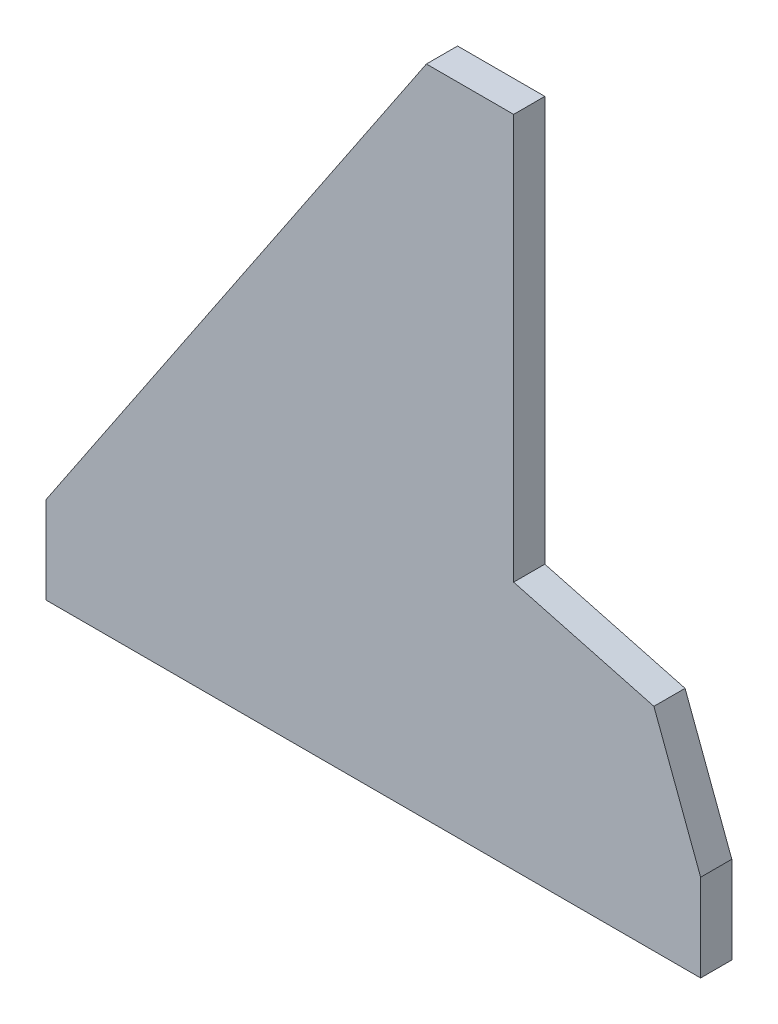
ISO-10303-21;
HEADER;
FILE_DESCRIPTION(('STEP AP214'),'2;1');
FILE_NAME('part.step','',(''),(''),'','','');
FILE_SCHEMA(('AUTOMOTIVE_DESIGN { 1 0 10303 214 1 1 1 1 }'));
ENDSEC;
DATA;
#1=APPLICATION_CONTEXT('core data for automotive mechanical design processes');
#2=APPLICATION_PROTOCOL_DEFINITION('international standard','automotive_design',2000,#1);
#3=PRODUCT_CONTEXT('',#1,'mechanical');
#4=PRODUCT('Part','Part','',(#3));
#5=PRODUCT_RELATED_PRODUCT_CATEGORY('part','',(#4));
#6=PRODUCT_DEFINITION_FORMATION('','',#4);
#7=PRODUCT_DEFINITION_CONTEXT('part definition',#1,'design');
#8=PRODUCT_DEFINITION('design','',#6,#7);
#9=PRODUCT_DEFINITION_SHAPE('','',#8);
#10=(LENGTH_UNIT() NAMED_UNIT(*) SI_UNIT(.MILLI.,.METRE.));
#11=(NAMED_UNIT(*) PLANE_ANGLE_UNIT() SI_UNIT($,.RADIAN.));
#12=(NAMED_UNIT(*) SI_UNIT($,.STERADIAN.) SOLID_ANGLE_UNIT());
#13=UNCERTAINTY_MEASURE_WITH_UNIT(LENGTH_MEASURE(1.E-05),#10,'distance_accuracy_value','');
#14=(GEOMETRIC_REPRESENTATION_CONTEXT(3) GLOBAL_UNCERTAINTY_ASSIGNED_CONTEXT((#13)) GLOBAL_UNIT_ASSIGNED_CONTEXT((#10,
#11,#12)) REPRESENTATION_CONTEXT('',''));
#15=CARTESIAN_POINT('',(0.,0.,0.));
#16=DIRECTION('',(0.,0.,1.));
#17=DIRECTION('',(1.,0.,0.));
#18=AXIS2_PLACEMENT_3D('',#15,#16,#17);
#19=CARTESIAN_POINT('',(-88.,210.,10.));
#20=DIRECTION('',(0.830643328156094,-0.556804868324414,0.));
#21=DIRECTION('',(0.556804868324414,0.830643328156094,0.));
#22=AXIS2_PLACEMENT_3D('',#19,#20,#21);
#23=PLANE('',#22);
#24=DIRECTION('',(-0.556804868324414,-0.830643328156094,0.));
#25=VECTOR('',#24,1.);
#26=CARTESIAN_POINT('',(-88.,210.,0.));
#27=LINE('',#26,#25);
#28=CARTESIAN_POINT('',(-88.,210.,0.));
#29=VERTEX_POINT('',#28);
#30=CARTESIAN_POINT('',(-210.,28.,0.));
#31=VERTEX_POINT('',#30);
#32=EDGE_CURVE('E129',#29,#31,#27,.T.);
#33=ORIENTED_EDGE('',*,*,#32,.T.);
#34=DIRECTION('',(0.,0.,-1.));
#35=VECTOR('',#34,1.);
#36=CARTESIAN_POINT('',(-210.,28.,10.));
#37=LINE('',#36,#35);
#38=CARTESIAN_POINT('',(-210.,28.,10.));
#39=VERTEX_POINT('',#38);
#40=EDGE_CURVE('E11',#39,#31,#37,.T.);
#41=ORIENTED_EDGE('',*,*,#40,.F.);
#42=DIRECTION('',(-0.556804868324414,-0.830643328156094,0.));
#43=VECTOR('',#42,1.);
#44=CARTESIAN_POINT('',(-88.,210.,10.));
#45=LINE('',#44,#43);
#46=CARTESIAN_POINT('',(-88.,210.,10.));
#47=VERTEX_POINT('',#46);
#48=EDGE_CURVE('E143',#47,#39,#45,.T.);
#49=ORIENTED_EDGE('',*,*,#48,.F.);
#50=DIRECTION('',(0.,0.,-1.));
#51=VECTOR('',#50,1.);
#52=CARTESIAN_POINT('',(-88.,210.,10.));
#53=LINE('',#52,#51);
#54=EDGE_CURVE('E125',#47,#29,#53,.T.);
#55=ORIENTED_EDGE('',*,*,#54,.T.);
#56=EDGE_LOOP('',(#33,#41,#49,#55));
#57=FACE_BOUND('',#56,.T.);
#58=ADVANCED_FACE('F33',(#57),#23,.F.);
#59=CARTESIAN_POINT('',(-210.,28.,10.));
#60=DIRECTION('',(1.,0.,0.));
#61=DIRECTION('',(0.,0.,-1.));
#62=AXIS2_PLACEMENT_3D('',#59,#60,#61);
#63=PLANE('',#62);
#64=DIRECTION('',(0.,-1.,0.));
#65=VECTOR('',#64,1.);
#66=CARTESIAN_POINT('',(-210.,28.,0.));
#67=LINE('',#66,#65);
#68=CARTESIAN_POINT('',(-210.,0.,0.));
#69=VERTEX_POINT('',#68);
#70=EDGE_CURVE('E132',#31,#69,#67,.T.);
#71=ORIENTED_EDGE('',*,*,#70,.T.);
#72=DIRECTION('',(0.,0.,-1.));
#73=VECTOR('',#72,1.);
#74=CARTESIAN_POINT('',(-210.,0.,10.));
#75=LINE('',#74,#73);
#76=CARTESIAN_POINT('',(-210.,0.,10.));
#77=VERTEX_POINT('',#76);
#78=EDGE_CURVE('E41',#77,#69,#75,.T.);
#79=ORIENTED_EDGE('',*,*,#78,.F.);
#80=DIRECTION('',(0.,-1.,0.));
#81=VECTOR('',#80,1.);
#82=CARTESIAN_POINT('',(-210.,28.,10.));
#83=LINE('',#82,#81);
#84=EDGE_CURVE('E92',#39,#77,#83,.T.);
#85=ORIENTED_EDGE('',*,*,#84,.F.);
#86=ORIENTED_EDGE('',*,*,#40,.T.);
#87=EDGE_LOOP('',(#71,#79,#85,#86));
#88=FACE_BOUND('',#87,.T.);
#89=ADVANCED_FACE('F178',(#88),#63,.F.);
#90=CARTESIAN_POINT('',(-210.,0.,10.));
#91=DIRECTION('',(0.,1.,0.));
#92=DIRECTION('',(0.,0.,1.));
#93=AXIS2_PLACEMENT_3D('',#90,#91,#92);
#94=PLANE('',#93);
#95=DIRECTION('',(1.,0.,0.));
#96=VECTOR('',#95,1.);
#97=CARTESIAN_POINT('',(-210.,0.,0.));
#98=LINE('',#97,#96);
#99=CARTESIAN_POINT('',(0.,0.,0.));
#100=VERTEX_POINT('',#99);
#101=EDGE_CURVE('E134',#69,#100,#98,.T.);
#102=ORIENTED_EDGE('',*,*,#101,.T.);
#103=DIRECTION('',(0.,0.,-1.));
#104=VECTOR('',#103,1.);
#105=CARTESIAN_POINT('',(0.,0.,10.));
#106=LINE('',#105,#104);
#107=CARTESIAN_POINT('',(0.,0.,10.));
#108=VERTEX_POINT('',#107);
#109=EDGE_CURVE('E150',#108,#100,#106,.T.);
#110=ORIENTED_EDGE('',*,*,#109,.F.);
#111=DIRECTION('',(1.,0.,0.));
#112=VECTOR('',#111,1.);
#113=CARTESIAN_POINT('',(-210.,0.,10.));
#114=LINE('',#113,#112);
#115=EDGE_CURVE('E158',#77,#108,#114,.T.);
#116=ORIENTED_EDGE('',*,*,#115,.F.);
#117=ORIENTED_EDGE('',*,*,#78,.T.);
#118=EDGE_LOOP('',(#102,#110,#116,#117));
#119=FACE_BOUND('',#118,.T.);
#120=ADVANCED_FACE('F156',(#119),#94,.F.);
#121=CARTESIAN_POINT('',(0.,0.,10.));
#122=DIRECTION('',(-1.,0.,0.));
#123=DIRECTION('',(0.,0.,1.));
#124=AXIS2_PLACEMENT_3D('',#121,#122,#123);
#125=PLANE('',#124);
#126=DIRECTION('',(0.,1.,0.));
#127=VECTOR('',#126,1.);
#128=CARTESIAN_POINT('',(0.,0.,0.));
#129=LINE('',#128,#127);
#130=CARTESIAN_POINT('',(0.,28.,0.));
#131=VERTEX_POINT('',#130);
#132=EDGE_CURVE('E136',#100,#131,#129,.T.);
#133=ORIENTED_EDGE('',*,*,#132,.T.);
#134=DIRECTION('',(0.,0.,-1.));
#135=VECTOR('',#134,1.);
#136=CARTESIAN_POINT('',(0.,28.,10.));
#137=LINE('',#136,#135);
#138=CARTESIAN_POINT('',(0.,28.,10.));
#139=VERTEX_POINT('',#138);
#140=EDGE_CURVE('E147',#139,#131,#137,.T.);
#141=ORIENTED_EDGE('',*,*,#140,.F.);
#142=DIRECTION('',(0.,1.,0.));
#143=VECTOR('',#142,1.);
#144=CARTESIAN_POINT('',(0.,0.,10.));
#145=LINE('',#144,#143);
#146=EDGE_CURVE('E170',#108,#139,#145,.T.);
#147=ORIENTED_EDGE('',*,*,#146,.F.);
#148=ORIENTED_EDGE('',*,*,#109,.T.);
#149=EDGE_LOOP('',(#133,#141,#147,#148));
#150=FACE_BOUND('',#149,.T.);
#151=ADVANCED_FACE('F166',(#150),#125,.F.);
#152=CARTESIAN_POINT('',(0.,28.,10.));
#153=DIRECTION('',(-0.936329177569045,-0.351123441588392,0.));
#154=DIRECTION('',(0.351123441588392,-0.936329177569045,0.));
#155=AXIS2_PLACEMENT_3D('',#152,#153,#154);
#156=PLANE('',#155);
#157=DIRECTION('',(-0.351123441588392,0.936329177569045,0.));
#158=VECTOR('',#157,1.);
#159=CARTESIAN_POINT('',(0.,28.,0.));
#160=LINE('',#159,#158);
#161=CARTESIAN_POINT('',(-15.,68.,0.));
#162=VERTEX_POINT('',#161);
#163=EDGE_CURVE('E138',#131,#162,#160,.T.);
#164=ORIENTED_EDGE('',*,*,#163,.T.);
#165=DIRECTION('',(0.,0.,-1.));
#166=VECTOR('',#165,1.);
#167=CARTESIAN_POINT('',(-15.,68.,10.));
#168=LINE('',#167,#166);
#169=CARTESIAN_POINT('',(-15.,68.,10.));
#170=VERTEX_POINT('',#169);
#171=EDGE_CURVE('E120',#170,#162,#168,.T.);
#172=ORIENTED_EDGE('',*,*,#171,.F.);
#173=DIRECTION('',(-0.351123441588392,0.936329177569045,0.));
#174=VECTOR('',#173,1.);
#175=CARTESIAN_POINT('',(0.,28.,10.));
#176=LINE('',#175,#174);
#177=EDGE_CURVE('E111',#139,#170,#176,.T.);
#178=ORIENTED_EDGE('',*,*,#177,.F.);
#179=ORIENTED_EDGE('',*,*,#140,.T.);
#180=EDGE_LOOP('',(#164,#172,#178,#179));
#181=FACE_BOUND('',#180,.T.);
#182=ADVANCED_FACE('F169',(#181),#156,.F.);
#183=CARTESIAN_POINT('',(-15.,68.,10.));
#184=DIRECTION('',(-0.257662650560331,-0.966234939601247,0.));
#185=DIRECTION('',(0.966234939601247,-0.257662650560331,0.));
#186=AXIS2_PLACEMENT_3D('',#183,#184,#185);
#187=PLANE('',#186);
#188=DIRECTION('',(-0.966234939601247,0.257662650560331,0.));
#189=VECTOR('',#188,1.);
#190=CARTESIAN_POINT('',(-15.,68.,0.));
#191=LINE('',#190,#189);
#192=CARTESIAN_POINT('',(-60.,80.,0.));
#193=VERTEX_POINT('',#192);
#194=EDGE_CURVE('E119',#162,#193,#191,.T.);
#195=ORIENTED_EDGE('',*,*,#194,.T.);
#196=DIRECTION('',(0.,0.,-1.));
#197=VECTOR('',#196,1.);
#198=CARTESIAN_POINT('',(-60.,80.,10.));
#199=LINE('',#198,#197);
#200=CARTESIAN_POINT('',(-60.,80.,10.));
#201=VERTEX_POINT('',#200);
#202=EDGE_CURVE('E116',#201,#193,#199,.T.);
#203=ORIENTED_EDGE('',*,*,#202,.F.);
#204=DIRECTION('',(-0.966234939601247,0.257662650560331,0.));
#205=VECTOR('',#204,1.);
#206=CARTESIAN_POINT('',(-15.,68.,10.));
#207=LINE('',#206,#205);
#208=EDGE_CURVE('E105',#170,#201,#207,.T.);
#209=ORIENTED_EDGE('',*,*,#208,.F.);
#210=ORIENTED_EDGE('',*,*,#171,.T.);
#211=EDGE_LOOP('',(#195,#203,#209,#210));
#212=FACE_BOUND('',#211,.T.);
#213=ADVANCED_FACE('F117',(#212),#187,.F.);
#214=CARTESIAN_POINT('',(-60.,80.,10.));
#215=DIRECTION('',(-1.,0.,0.));
#216=DIRECTION('',(0.,-1.,0.));
#217=AXIS2_PLACEMENT_3D('',#214,#215,#216);
#218=PLANE('',#217);
#219=DIRECTION('',(0.,1.,0.));
#220=VECTOR('',#219,1.);
#221=CARTESIAN_POINT('',(-60.,80.,0.));
#222=LINE('',#221,#220);
#223=CARTESIAN_POINT('',(-60.,210.,0.));
#224=VERTEX_POINT('',#223);
#225=EDGE_CURVE('E78',#193,#224,#222,.T.);
#226=ORIENTED_EDGE('',*,*,#225,.T.);
#227=DIRECTION('',(0.,0.,-1.));
#228=VECTOR('',#227,1.);
#229=CARTESIAN_POINT('',(-60.,210.,10.));
#230=LINE('',#229,#228);
#231=CARTESIAN_POINT('',(-60.,210.,10.));
#232=VERTEX_POINT('',#231);
#233=EDGE_CURVE('E121',#232,#224,#230,.T.);
#234=ORIENTED_EDGE('',*,*,#233,.F.);
#235=DIRECTION('',(0.,1.,0.));
#236=VECTOR('',#235,1.);
#237=CARTESIAN_POINT('',(-60.,80.,10.));
#238=LINE('',#237,#236);
#239=EDGE_CURVE('E109',#201,#232,#238,.T.);
#240=ORIENTED_EDGE('',*,*,#239,.F.);
#241=ORIENTED_EDGE('',*,*,#202,.T.);
#242=EDGE_LOOP('',(#226,#234,#240,#241));
#243=FACE_BOUND('',#242,.T.);
#244=ADVANCED_FACE('F123',(#243),#218,.F.);
#245=CARTESIAN_POINT('',(-60.,210.,10.));
#246=DIRECTION('',(0.,-1.,0.));
#247=DIRECTION('',(0.,0.,-1.));
#248=AXIS2_PLACEMENT_3D('',#245,#246,#247);
#249=PLANE('',#248);
#250=DIRECTION('',(-1.,0.,0.));
#251=VECTOR('',#250,1.);
#252=CARTESIAN_POINT('',(-60.,210.,0.));
#253=LINE('',#252,#251);
#254=EDGE_CURVE('E84',#224,#29,#253,.T.);
#255=ORIENTED_EDGE('',*,*,#254,.T.);
#256=ORIENTED_EDGE('',*,*,#54,.F.);
#257=DIRECTION('',(-1.,0.,0.));
#258=VECTOR('',#257,1.);
#259=CARTESIAN_POINT('',(-60.,210.,10.));
#260=LINE('',#259,#258);
#261=EDGE_CURVE('E49',#232,#47,#260,.T.);
#262=ORIENTED_EDGE('',*,*,#261,.F.);
#263=ORIENTED_EDGE('',*,*,#233,.T.);
#264=EDGE_LOOP('',(#255,#256,#262,#263));
#265=FACE_BOUND('',#264,.T.);
#266=ADVANCED_FACE('F194',(#265),#249,.F.);
#267=CARTESIAN_POINT('',(0.,0.,10.));
#268=DIRECTION('',(0.,0.,-1.));
#269=DIRECTION('',(-1.,0.,0.));
#270=AXIS2_PLACEMENT_3D('',#267,#268,#269);
#271=PLANE('',#270);
#272=ORIENTED_EDGE('',*,*,#48,.T.);
#273=ORIENTED_EDGE('',*,*,#84,.T.);
#274=ORIENTED_EDGE('',*,*,#115,.T.);
#275=ORIENTED_EDGE('',*,*,#146,.T.);
#276=ORIENTED_EDGE('',*,*,#177,.T.);
#277=ORIENTED_EDGE('',*,*,#208,.T.);
#278=ORIENTED_EDGE('',*,*,#239,.T.);
#279=ORIENTED_EDGE('',*,*,#261,.T.);
#280=EDGE_LOOP('',(#272,#273,#274,#275,#276,#277,#278,#279));
#281=FACE_BOUND('',#280,.T.);
#282=ADVANCED_FACE('F107',(#281),#271,.F.);
#283=CARTESIAN_POINT('',(0.,0.,0.));
#284=DIRECTION('',(0.,0.,-1.));
#285=DIRECTION('',(-1.,0.,0.));
#286=AXIS2_PLACEMENT_3D('',#283,#284,#285);
#287=PLANE('',#286);
#288=ORIENTED_EDGE('',*,*,#32,.F.);
#289=ORIENTED_EDGE('',*,*,#254,.F.);
#290=ORIENTED_EDGE('',*,*,#225,.F.);
#291=ORIENTED_EDGE('',*,*,#194,.F.);
#292=ORIENTED_EDGE('',*,*,#163,.F.);
#293=ORIENTED_EDGE('',*,*,#132,.F.);
#294=ORIENTED_EDGE('',*,*,#101,.F.);
#295=ORIENTED_EDGE('',*,*,#70,.F.);
#296=EDGE_LOOP('',(#288,#289,#290,#291,#292,#293,#294,#295));
#297=FACE_BOUND('',#296,.T.);
#298=ADVANCED_FACE('F162',(#297),#287,.T.);
#299=CLOSED_SHELL('',(#58,#89,#120,#151,#182,#213,#244,#266,#282,#298));
#300=MANIFOLD_SOLID_BREP('B2',#299);
#301=ADVANCED_BREP_SHAPE_REPRESENTATION('',(#18,#300),#14);
#302=SHAPE_DEFINITION_REPRESENTATION(#9,#301);
ENDSEC;
END-ISO-10303-21;
